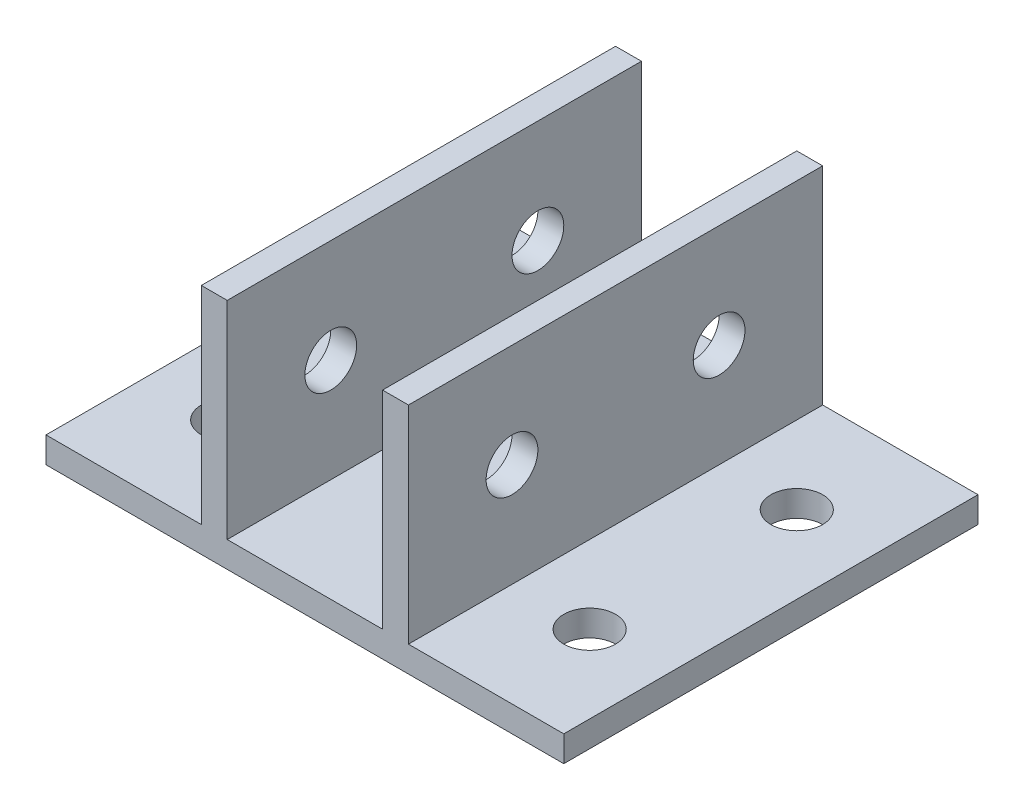
ISO-10303-21;
HEADER;
FILE_DESCRIPTION(('STEP AP214'),'2;1');
FILE_NAME('part.step','',(''),(''),'','','');
FILE_SCHEMA(('AUTOMOTIVE_DESIGN { 1 0 10303 214 1 1 1 1 }'));
ENDSEC;
DATA;
#1=APPLICATION_CONTEXT('core data for automotive mechanical design processes');
#2=APPLICATION_PROTOCOL_DEFINITION('international standard','automotive_design',2000,#1);
#3=PRODUCT_CONTEXT('',#1,'mechanical');
#4=PRODUCT('Part','Part','',(#3));
#5=PRODUCT_RELATED_PRODUCT_CATEGORY('part','',(#4));
#6=PRODUCT_DEFINITION_FORMATION('','',#4);
#7=PRODUCT_DEFINITION_CONTEXT('part definition',#1,'design');
#8=PRODUCT_DEFINITION('design','',#6,#7);
#9=PRODUCT_DEFINITION_SHAPE('','',#8);
#10=(LENGTH_UNIT() NAMED_UNIT(*) SI_UNIT(.MILLI.,.METRE.));
#11=(NAMED_UNIT(*) PLANE_ANGLE_UNIT() SI_UNIT($,.RADIAN.));
#12=(NAMED_UNIT(*) SI_UNIT($,.STERADIAN.) SOLID_ANGLE_UNIT());
#13=UNCERTAINTY_MEASURE_WITH_UNIT(LENGTH_MEASURE(1.E-05),#10,'distance_accuracy_value','');
#14=(GEOMETRIC_REPRESENTATION_CONTEXT(3) GLOBAL_UNCERTAINTY_ASSIGNED_CONTEXT((#13)) GLOBAL_UNIT_ASSIGNED_CONTEXT((#10,
#11,#12)) REPRESENTATION_CONTEXT('',''));
#15=CARTESIAN_POINT('',(0.,0.,0.));
#16=DIRECTION('',(0.,0.,1.));
#17=DIRECTION('',(1.,0.,0.));
#18=AXIS2_PLACEMENT_3D('',#15,#16,#17);
#19=CARTESIAN_POINT('',(0.,0.,50.8));
#20=DIRECTION('',(0.,1.,0.));
#21=DIRECTION('',(0.,0.,1.));
#22=AXIS2_PLACEMENT_3D('',#19,#20,#21);
#23=PLANE('',#22);
#24=CARTESIAN_POINT('',(53.975,0.,38.1));
#25=DIRECTION('',(0.,1.,0.));
#26=DIRECTION('',(-1.,0.,0.));
#27=AXIS2_PLACEMENT_3D('',#24,#25,#26);
#28=CIRCLE('',#27,3.175);
#29=CARTESIAN_POINT('',(50.8,0.,38.1));
#30=VERTEX_POINT('',#29);
#31=EDGE_CURVE('E280',#30,#30,#28,.F.);
#32=ORIENTED_EDGE('',*,*,#31,.F.);
#33=EDGE_LOOP('',(#32));
#34=FACE_BOUND('',#33,.T.);
#35=CARTESIAN_POINT('',(9.525,0.,12.7));
#36=DIRECTION('',(0.,1.,0.));
#37=DIRECTION('',(-1.,0.,0.));
#38=AXIS2_PLACEMENT_3D('',#35,#36,#37);
#39=CIRCLE('',#38,3.175);
#40=CARTESIAN_POINT('',(6.35,0.,12.7));
#41=VERTEX_POINT('',#40);
#42=EDGE_CURVE('E269',#41,#41,#39,.T.);
#43=ORIENTED_EDGE('',*,*,#42,.T.);
#44=EDGE_LOOP('',(#43));
#45=FACE_BOUND('',#44,.T.);
#46=CARTESIAN_POINT('',(9.525,0.,38.1));
#47=DIRECTION('',(0.,1.,0.));
#48=DIRECTION('',(-1.,0.,0.));
#49=AXIS2_PLACEMENT_3D('',#46,#47,#48);
#50=CIRCLE('',#49,3.175);
#51=CARTESIAN_POINT('',(6.35,0.,38.1));
#52=VERTEX_POINT('',#51);
#53=EDGE_CURVE('E286',#52,#52,#50,.F.);
#54=ORIENTED_EDGE('',*,*,#53,.F.);
#55=EDGE_LOOP('',(#54));
#56=FACE_BOUND('',#55,.T.);
#57=DIRECTION('',(1.,0.,0.));
#58=VECTOR('',#57,1.);
#59=CARTESIAN_POINT('',(0.,0.,0.));
#60=LINE('',#59,#58);
#61=CARTESIAN_POINT('',(0.,0.,0.));
#62=VERTEX_POINT('',#61);
#63=CARTESIAN_POINT('',(63.5,0.,0.));
#64=VERTEX_POINT('',#63);
#65=EDGE_CURVE('E169',#62,#64,#60,.T.);
#66=ORIENTED_EDGE('',*,*,#65,.T.);
#67=DIRECTION('',(0.,0.,-1.));
#68=VECTOR('',#67,1.);
#69=CARTESIAN_POINT('',(63.5,0.,50.8));
#70=LINE('',#69,#68);
#71=CARTESIAN_POINT('',(63.5,0.,50.8));
#72=VERTEX_POINT('',#71);
#73=EDGE_CURVE('E54',#72,#64,#70,.T.);
#74=ORIENTED_EDGE('',*,*,#73,.F.);
#75=DIRECTION('',(1.,0.,0.));
#76=VECTOR('',#75,1.);
#77=CARTESIAN_POINT('',(0.,0.,50.8));
#78=LINE('',#77,#76);
#79=CARTESIAN_POINT('',(0.,0.,50.8));
#80=VERTEX_POINT('',#79);
#81=EDGE_CURVE('E117',#80,#72,#78,.T.);
#82=ORIENTED_EDGE('',*,*,#81,.F.);
#83=DIRECTION('',(0.,0.,-1.));
#84=VECTOR('',#83,1.);
#85=CARTESIAN_POINT('',(0.,0.,50.8));
#86=LINE('',#85,#84);
#87=EDGE_CURVE('E13',#80,#62,#86,.T.);
#88=ORIENTED_EDGE('',*,*,#87,.T.);
#89=EDGE_LOOP('',(#66,#74,#82,#88));
#90=FACE_BOUND('',#89,.T.);
#91=CARTESIAN_POINT('',(53.975,0.,12.7));
#92=DIRECTION('',(0.,1.,0.));
#93=DIRECTION('',(-1.,0.,0.));
#94=AXIS2_PLACEMENT_3D('',#91,#92,#93);
#95=CIRCLE('',#94,3.175);
#96=CARTESIAN_POINT('',(50.8,0.,12.7));
#97=VERTEX_POINT('',#96);
#98=EDGE_CURVE('E270',#97,#97,#95,.T.);
#99=ORIENTED_EDGE('',*,*,#98,.T.);
#100=EDGE_LOOP('',(#99));
#101=FACE_BOUND('',#100,.T.);
#102=ADVANCED_FACE('F45',(#34,#45,#56,#90,#101),#23,.F.);
#103=CARTESIAN_POINT('',(63.5,3.17500000000001,50.8));
#104=DIRECTION('',(0.,-1.,0.));
#105=DIRECTION('',(1.,0.,0.));
#106=AXIS2_PLACEMENT_3D('',#103,#104,#105);
#107=PLANE('',#106);
#108=CARTESIAN_POINT('',(53.975,3.175,12.7));
#109=DIRECTION('',(0.,1.,0.));
#110=DIRECTION('',(-1.,0.,0.));
#111=AXIS2_PLACEMENT_3D('',#108,#109,#110);
#112=CIRCLE('',#111,3.175);
#113=CARTESIAN_POINT('',(50.8,3.175,12.7));
#114=VERTEX_POINT('',#113);
#115=EDGE_CURVE('E275',#114,#114,#112,.T.);
#116=ORIENTED_EDGE('',*,*,#115,.F.);
#117=EDGE_LOOP('',(#116));
#118=FACE_BOUND('',#117,.T.);
#119=DIRECTION('',(-1.,0.,0.));
#120=VECTOR('',#119,1.);
#121=CARTESIAN_POINT('',(63.5,3.17500000000001,0.));
#122=LINE('',#121,#120);
#123=CARTESIAN_POINT('',(63.5,3.17500000000001,0.));
#124=VERTEX_POINT('',#123);
#125=CARTESIAN_POINT('',(44.45,3.175,0.));
#126=VERTEX_POINT('',#125);
#127=EDGE_CURVE('E174',#124,#126,#122,.T.);
#128=ORIENTED_EDGE('',*,*,#127,.T.);
#129=DIRECTION('',(0.,0.,-1.));
#130=VECTOR('',#129,1.);
#131=CARTESIAN_POINT('',(44.45,3.175,50.8));
#132=LINE('',#131,#130);
#133=CARTESIAN_POINT('',(44.45,3.175,50.8));
#134=VERTEX_POINT('',#133);
#135=EDGE_CURVE('E205',#134,#126,#132,.T.);
#136=ORIENTED_EDGE('',*,*,#135,.F.);
#137=DIRECTION('',(-1.,0.,0.));
#138=VECTOR('',#137,1.);
#139=CARTESIAN_POINT('',(63.5,3.17500000000001,50.8));
#140=LINE('',#139,#138);
#141=CARTESIAN_POINT('',(63.5,3.17500000000001,50.8));
#142=VERTEX_POINT('',#141);
#143=EDGE_CURVE('E235',#142,#134,#140,.T.);
#144=ORIENTED_EDGE('',*,*,#143,.F.);
#145=DIRECTION('',(0.,0.,-1.));
#146=VECTOR('',#145,1.);
#147=CARTESIAN_POINT('',(63.5,3.17500000000001,50.8));
#148=LINE('',#147,#146);
#149=EDGE_CURVE('E208',#142,#124,#148,.T.);
#150=ORIENTED_EDGE('',*,*,#149,.T.);
#151=EDGE_LOOP('',(#128,#136,#144,#150));
#152=FACE_BOUND('',#151,.T.);
#153=CARTESIAN_POINT('',(53.975,3.175,38.1));
#154=DIRECTION('',(0.,1.,0.));
#155=DIRECTION('',(-1.,0.,0.));
#156=AXIS2_PLACEMENT_3D('',#153,#154,#155);
#157=CIRCLE('',#156,3.175);
#158=CARTESIAN_POINT('',(50.8,3.175,38.1));
#159=VERTEX_POINT('',#158);
#160=EDGE_CURVE('E283',#159,#159,#157,.F.);
#161=ORIENTED_EDGE('',*,*,#160,.T.);
#162=EDGE_LOOP('',(#161));
#163=FACE_BOUND('',#162,.T.);
#164=ADVANCED_FACE('F225',(#118,#152,#163),#107,.F.);
#165=CARTESIAN_POINT('',(19.05,3.175,50.8));
#166=DIRECTION('',(0.,-1.,0.));
#167=DIRECTION('',(1.,0.,0.));
#168=AXIS2_PLACEMENT_3D('',#165,#166,#167);
#169=PLANE('',#168);
#170=DIRECTION('',(-1.,0.,0.));
#171=VECTOR('',#170,1.);
#172=CARTESIAN_POINT('',(19.05,3.175,0.));
#173=LINE('',#172,#171);
#174=CARTESIAN_POINT('',(19.05,3.175,0.));
#175=VERTEX_POINT('',#174);
#176=CARTESIAN_POINT('',(0.,3.175,0.));
#177=VERTEX_POINT('',#176);
#178=EDGE_CURVE('E109',#175,#177,#173,.T.);
#179=ORIENTED_EDGE('',*,*,#178,.T.);
#180=DIRECTION('',(0.,0.,-1.));
#181=VECTOR('',#180,1.);
#182=CARTESIAN_POINT('',(0.,3.175,50.8));
#183=LINE('',#182,#181);
#184=CARTESIAN_POINT('',(0.,3.175,50.8));
#185=VERTEX_POINT('',#184);
#186=EDGE_CURVE('E162',#185,#177,#183,.T.);
#187=ORIENTED_EDGE('',*,*,#186,.F.);
#188=DIRECTION('',(-1.,0.,0.));
#189=VECTOR('',#188,1.);
#190=CARTESIAN_POINT('',(19.05,3.175,50.8));
#191=LINE('',#190,#189);
#192=CARTESIAN_POINT('',(19.05,3.175,50.8));
#193=VERTEX_POINT('',#192);
#194=EDGE_CURVE('E62',#193,#185,#191,.T.);
#195=ORIENTED_EDGE('',*,*,#194,.F.);
#196=DIRECTION('',(0.,0.,-1.));
#197=VECTOR('',#196,1.);
#198=CARTESIAN_POINT('',(19.05,3.175,50.8));
#199=LINE('',#198,#197);
#200=EDGE_CURVE('E158',#193,#175,#199,.T.);
#201=ORIENTED_EDGE('',*,*,#200,.T.);
#202=EDGE_LOOP('',(#179,#187,#195,#201));
#203=FACE_BOUND('',#202,.T.);
#204=CARTESIAN_POINT('',(9.525,3.175,38.1));
#205=DIRECTION('',(0.,1.,0.));
#206=DIRECTION('',(-1.,0.,0.));
#207=AXIS2_PLACEMENT_3D('',#204,#205,#206);
#208=CIRCLE('',#207,3.175);
#209=CARTESIAN_POINT('',(6.35,3.175,38.1));
#210=VERTEX_POINT('',#209);
#211=EDGE_CURVE('E264',#210,#210,#208,.F.);
#212=ORIENTED_EDGE('',*,*,#211,.T.);
#213=EDGE_LOOP('',(#212));
#214=FACE_BOUND('',#213,.T.);
#215=CARTESIAN_POINT('',(9.525,3.175,12.7));
#216=DIRECTION('',(0.,1.,0.));
#217=DIRECTION('',(-1.,0.,0.));
#218=AXIS2_PLACEMENT_3D('',#215,#216,#217);
#219=CIRCLE('',#218,3.175);
#220=CARTESIAN_POINT('',(6.35,3.175,12.7));
#221=VERTEX_POINT('',#220);
#222=EDGE_CURVE('E267',#221,#221,#219,.T.);
#223=ORIENTED_EDGE('',*,*,#222,.F.);
#224=EDGE_LOOP('',(#223));
#225=FACE_BOUND('',#224,.T.);
#226=ADVANCED_FACE('F257',(#203,#214,#225),#169,.F.);
#227=CARTESIAN_POINT('',(0.,3.175,50.8));
#228=DIRECTION('',(1.,0.,0.));
#229=DIRECTION('',(0.,1.,0.));
#230=AXIS2_PLACEMENT_3D('',#227,#228,#229);
#231=PLANE('',#230);
#232=DIRECTION('',(0.,-1.,0.));
#233=VECTOR('',#232,1.);
#234=CARTESIAN_POINT('',(0.,3.175,0.));
#235=LINE('',#234,#233);
#236=EDGE_CURVE('E166',#177,#62,#235,.T.);
#237=ORIENTED_EDGE('',*,*,#236,.T.);
#238=ORIENTED_EDGE('',*,*,#87,.F.);
#239=DIRECTION('',(0.,-1.,0.));
#240=VECTOR('',#239,1.);
#241=CARTESIAN_POINT('',(0.,3.175,50.8));
#242=LINE('',#241,#240);
#243=EDGE_CURVE('E189',#185,#80,#242,.T.);
#244=ORIENTED_EDGE('',*,*,#243,.F.);
#245=ORIENTED_EDGE('',*,*,#186,.T.);
#246=EDGE_LOOP('',(#237,#238,#244,#245));
#247=FACE_BOUND('',#246,.T.);
#248=ADVANCED_FACE('F47',(#247),#231,.F.);
#249=CARTESIAN_POINT('',(63.5,0.,50.8));
#250=DIRECTION('',(-1.,0.,0.));
#251=DIRECTION('',(0.,0.,1.));
#252=AXIS2_PLACEMENT_3D('',#249,#250,#251);
#253=PLANE('',#252);
#254=DIRECTION('',(0.,1.,0.));
#255=VECTOR('',#254,1.);
#256=CARTESIAN_POINT('',(63.5,0.,0.));
#257=LINE('',#256,#255);
#258=EDGE_CURVE('E172',#64,#124,#257,.T.);
#259=ORIENTED_EDGE('',*,*,#258,.T.);
#260=ORIENTED_EDGE('',*,*,#149,.F.);
#261=DIRECTION('',(0.,1.,0.));
#262=VECTOR('',#261,1.);
#263=CARTESIAN_POINT('',(63.5,0.,50.8));
#264=LINE('',#263,#262);
#265=EDGE_CURVE('E216',#72,#142,#264,.T.);
#266=ORIENTED_EDGE('',*,*,#265,.F.);
#267=ORIENTED_EDGE('',*,*,#73,.T.);
#268=EDGE_LOOP('',(#259,#260,#266,#267));
#269=FACE_BOUND('',#268,.T.);
#270=ADVANCED_FACE('F214',(#269),#253,.F.);
#271=CARTESIAN_POINT('',(44.45,3.175,50.8));
#272=DIRECTION('',(-1.,0.,0.));
#273=DIRECTION('',(0.,0.,1.));
#274=AXIS2_PLACEMENT_3D('',#271,#272,#273);
#275=PLANE('',#274);
#276=CARTESIAN_POINT('',(44.45,15.875,12.7));
#277=DIRECTION('',(-1.,0.,0.));
#278=DIRECTION('',(0.,0.,1.));
#279=AXIS2_PLACEMENT_3D('',#276,#277,#278);
#280=CIRCLE('',#279,3.175);
#281=CARTESIAN_POINT('',(44.45,15.875,15.875));
#282=VERTEX_POINT('',#281);
#283=EDGE_CURVE('E170',#282,#282,#280,.T.);
#284=ORIENTED_EDGE('',*,*,#283,.T.);
#285=EDGE_LOOP('',(#284));
#286=FACE_BOUND('',#285,.T.);
#287=CARTESIAN_POINT('',(44.45,15.875,38.1));
#288=DIRECTION('',(-1.,0.,0.));
#289=DIRECTION('',(0.,0.,1.));
#290=AXIS2_PLACEMENT_3D('',#287,#288,#289);
#291=CIRCLE('',#290,3.175);
#292=CARTESIAN_POINT('',(44.45,15.875,41.275));
#293=VERTEX_POINT('',#292);
#294=EDGE_CURVE('E302',#293,#293,#291,.T.);
#295=ORIENTED_EDGE('',*,*,#294,.T.);
#296=EDGE_LOOP('',(#295));
#297=FACE_BOUND('',#296,.T.);
#298=DIRECTION('',(0.,1.,0.));
#299=VECTOR('',#298,1.);
#300=CARTESIAN_POINT('',(44.45,3.175,0.));
#301=LINE('',#300,#299);
#302=CARTESIAN_POINT('',(44.45,28.575,0.));
#303=VERTEX_POINT('',#302);
#304=EDGE_CURVE('E176',#126,#303,#301,.T.);
#305=ORIENTED_EDGE('',*,*,#304,.T.);
#306=DIRECTION('',(0.,0.,-1.));
#307=VECTOR('',#306,1.);
#308=CARTESIAN_POINT('',(44.45,28.575,50.8));
#309=LINE('',#308,#307);
#310=CARTESIAN_POINT('',(44.45,28.575,50.8));
#311=VERTEX_POINT('',#310);
#312=EDGE_CURVE('E202',#311,#303,#309,.T.);
#313=ORIENTED_EDGE('',*,*,#312,.F.);
#314=DIRECTION('',(0.,1.,0.));
#315=VECTOR('',#314,1.);
#316=CARTESIAN_POINT('',(44.45,3.175,50.8));
#317=LINE('',#316,#315);
#318=EDGE_CURVE('E232',#134,#311,#317,.T.);
#319=ORIENTED_EDGE('',*,*,#318,.F.);
#320=ORIENTED_EDGE('',*,*,#135,.T.);
#321=EDGE_LOOP('',(#305,#313,#319,#320));
#322=FACE_BOUND('',#321,.T.);
#323=ADVANCED_FACE('F230',(#286,#297,#322),#275,.F.);
#324=CARTESIAN_POINT('',(44.45,28.575,50.8));
#325=DIRECTION('',(0.,-1.,0.));
#326=DIRECTION('',(1.,0.,0.));
#327=AXIS2_PLACEMENT_3D('',#324,#325,#326);
#328=PLANE('',#327);
#329=DIRECTION('',(-1.,0.,0.));
#330=VECTOR('',#329,1.);
#331=CARTESIAN_POINT('',(44.45,28.575,0.));
#332=LINE('',#331,#330);
#333=CARTESIAN_POINT('',(41.275,28.575,0.));
#334=VERTEX_POINT('',#333);
#335=EDGE_CURVE('E178',#303,#334,#332,.T.);
#336=ORIENTED_EDGE('',*,*,#335,.T.);
#337=DIRECTION('',(0.,0.,-1.));
#338=VECTOR('',#337,1.);
#339=CARTESIAN_POINT('',(41.275,28.575,50.8));
#340=LINE('',#339,#338);
#341=CARTESIAN_POINT('',(41.275,28.575,50.8));
#342=VERTEX_POINT('',#341);
#343=EDGE_CURVE('E199',#342,#334,#340,.T.);
#344=ORIENTED_EDGE('',*,*,#343,.F.);
#345=DIRECTION('',(-1.,0.,0.));
#346=VECTOR('',#345,1.);
#347=CARTESIAN_POINT('',(44.45,28.575,50.8));
#348=LINE('',#347,#346);
#349=EDGE_CURVE('E234',#311,#342,#348,.T.);
#350=ORIENTED_EDGE('',*,*,#349,.F.);
#351=ORIENTED_EDGE('',*,*,#312,.T.);
#352=EDGE_LOOP('',(#336,#344,#350,#351));
#353=FACE_BOUND('',#352,.T.);
#354=ADVANCED_FACE('F352',(#353),#328,.F.);
#355=CARTESIAN_POINT('',(41.275,28.575,50.8));
#356=DIRECTION('',(1.,0.,0.));
#357=DIRECTION('',(0.,1.,0.));
#358=AXIS2_PLACEMENT_3D('',#355,#356,#357);
#359=PLANE('',#358);
#360=CARTESIAN_POINT('',(41.275,15.875,12.7));
#361=DIRECTION('',(1.,0.,0.));
#362=DIRECTION('',(0.,1.,0.));
#363=AXIS2_PLACEMENT_3D('',#360,#361,#362);
#364=CIRCLE('',#363,3.175);
#365=CARTESIAN_POINT('',(41.275,19.05,12.7));
#366=VERTEX_POINT('',#365);
#367=EDGE_CURVE('E308',#366,#366,#364,.T.);
#368=ORIENTED_EDGE('',*,*,#367,.T.);
#369=EDGE_LOOP('',(#368));
#370=FACE_BOUND('',#369,.T.);
#371=CARTESIAN_POINT('',(41.275,15.875,38.1));
#372=DIRECTION('',(1.,0.,0.));
#373=DIRECTION('',(0.,1.,0.));
#374=AXIS2_PLACEMENT_3D('',#371,#372,#373);
#375=CIRCLE('',#374,3.175);
#376=CARTESIAN_POINT('',(41.275,19.05,38.1));
#377=VERTEX_POINT('',#376);
#378=EDGE_CURVE('E299',#377,#377,#375,.T.);
#379=ORIENTED_EDGE('',*,*,#378,.T.);
#380=EDGE_LOOP('',(#379));
#381=FACE_BOUND('',#380,.T.);
#382=DIRECTION('',(0.,-1.,0.));
#383=VECTOR('',#382,1.);
#384=CARTESIAN_POINT('',(41.275,28.575,0.));
#385=LINE('',#384,#383);
#386=CARTESIAN_POINT('',(41.275,3.175,0.));
#387=VERTEX_POINT('',#386);
#388=EDGE_CURVE('E180',#334,#387,#385,.T.);
#389=ORIENTED_EDGE('',*,*,#388,.T.);
#390=DIRECTION('',(0.,0.,-1.));
#391=VECTOR('',#390,1.);
#392=CARTESIAN_POINT('',(41.275,3.175,50.8));
#393=LINE('',#392,#391);
#394=CARTESIAN_POINT('',(41.275,3.175,50.8));
#395=VERTEX_POINT('',#394);
#396=EDGE_CURVE('E196',#395,#387,#393,.T.);
#397=ORIENTED_EDGE('',*,*,#396,.F.);
#398=DIRECTION('',(0.,-1.,0.));
#399=VECTOR('',#398,1.);
#400=CARTESIAN_POINT('',(41.275,28.575,50.8));
#401=LINE('',#400,#399);
#402=EDGE_CURVE('E237',#342,#395,#401,.T.);
#403=ORIENTED_EDGE('',*,*,#402,.F.);
#404=ORIENTED_EDGE('',*,*,#343,.T.);
#405=EDGE_LOOP('',(#389,#397,#403,#404));
#406=FACE_BOUND('',#405,.T.);
#407=ADVANCED_FACE('F355',(#370,#381,#406),#359,.F.);
#408=CARTESIAN_POINT('',(41.275,3.175,50.8));
#409=DIRECTION('',(0.,-1.,0.));
#410=DIRECTION('',(1.,0.,0.));
#411=AXIS2_PLACEMENT_3D('',#408,#409,#410);
#412=PLANE('',#411);
#413=DIRECTION('',(-1.,0.,0.));
#414=VECTOR('',#413,1.);
#415=CARTESIAN_POINT('',(41.275,3.175,0.));
#416=LINE('',#415,#414);
#417=CARTESIAN_POINT('',(22.225,3.175,0.));
#418=VERTEX_POINT('',#417);
#419=EDGE_CURVE('E182',#387,#418,#416,.T.);
#420=ORIENTED_EDGE('',*,*,#419,.T.);
#421=DIRECTION('',(0.,0.,-1.));
#422=VECTOR('',#421,1.);
#423=CARTESIAN_POINT('',(22.225,3.175,50.8));
#424=LINE('',#423,#422);
#425=CARTESIAN_POINT('',(22.225,3.175,50.8));
#426=VERTEX_POINT('',#425);
#427=EDGE_CURVE('E193',#426,#418,#424,.T.);
#428=ORIENTED_EDGE('',*,*,#427,.F.);
#429=DIRECTION('',(-1.,0.,0.));
#430=VECTOR('',#429,1.);
#431=CARTESIAN_POINT('',(41.275,3.175,50.8));
#432=LINE('',#431,#430);
#433=EDGE_CURVE('E243',#395,#426,#432,.T.);
#434=ORIENTED_EDGE('',*,*,#433,.F.);
#435=ORIENTED_EDGE('',*,*,#396,.T.);
#436=EDGE_LOOP('',(#420,#428,#434,#435));
#437=FACE_BOUND('',#436,.T.);
#438=ADVANCED_FACE('F249',(#437),#412,.F.);
#439=CARTESIAN_POINT('',(22.225,3.175,50.8));
#440=DIRECTION('',(-1.,0.,0.));
#441=DIRECTION('',(0.,-1.,0.));
#442=AXIS2_PLACEMENT_3D('',#439,#440,#441);
#443=PLANE('',#442);
#444=CARTESIAN_POINT('',(22.225,15.875,12.7));
#445=DIRECTION('',(-1.,0.,0.));
#446=DIRECTION('',(0.,-1.,0.));
#447=AXIS2_PLACEMENT_3D('',#444,#445,#446);
#448=CIRCLE('',#447,3.175);
#449=CARTESIAN_POINT('',(22.225,12.7,12.7));
#450=VERTEX_POINT('',#449);
#451=EDGE_CURVE('E305',#450,#450,#448,.T.);
#452=ORIENTED_EDGE('',*,*,#451,.T.);
#453=EDGE_LOOP('',(#452));
#454=FACE_BOUND('',#453,.T.);
#455=CARTESIAN_POINT('',(22.225,15.875,38.1));
#456=DIRECTION('',(-1.,0.,0.));
#457=DIRECTION('',(0.,-1.,0.));
#458=AXIS2_PLACEMENT_3D('',#455,#456,#457);
#459=CIRCLE('',#458,3.175);
#460=CARTESIAN_POINT('',(22.225,12.7,38.1));
#461=VERTEX_POINT('',#460);
#462=EDGE_CURVE('E294',#461,#461,#459,.T.);
#463=ORIENTED_EDGE('',*,*,#462,.T.);
#464=EDGE_LOOP('',(#463));
#465=FACE_BOUND('',#464,.T.);
#466=DIRECTION('',(0.,1.,0.));
#467=VECTOR('',#466,1.);
#468=CARTESIAN_POINT('',(22.225,3.175,0.));
#469=LINE('',#468,#467);
#470=CARTESIAN_POINT('',(22.225,28.575,0.));
#471=VERTEX_POINT('',#470);
#472=EDGE_CURVE('E184',#418,#471,#469,.T.);
#473=ORIENTED_EDGE('',*,*,#472,.T.);
#474=DIRECTION('',(0.,0.,-1.));
#475=VECTOR('',#474,1.);
#476=CARTESIAN_POINT('',(22.225,28.575,50.8));
#477=LINE('',#476,#475);
#478=CARTESIAN_POINT('',(22.225,28.575,50.8));
#479=VERTEX_POINT('',#478);
#480=EDGE_CURVE('E157',#479,#471,#477,.T.);
#481=ORIENTED_EDGE('',*,*,#480,.F.);
#482=DIRECTION('',(0.,1.,0.));
#483=VECTOR('',#482,1.);
#484=CARTESIAN_POINT('',(22.225,3.175,50.8));
#485=LINE('',#484,#483);
#486=EDGE_CURVE('E148',#426,#479,#485,.T.);
#487=ORIENTED_EDGE('',*,*,#486,.F.);
#488=ORIENTED_EDGE('',*,*,#427,.T.);
#489=EDGE_LOOP('',(#473,#481,#487,#488));
#490=FACE_BOUND('',#489,.T.);
#491=ADVANCED_FACE('F253',(#454,#465,#490),#443,.F.);
#492=CARTESIAN_POINT('',(22.225,28.575,50.8));
#493=DIRECTION('',(0.,-1.,0.));
#494=DIRECTION('',(0.,0.,-1.));
#495=AXIS2_PLACEMENT_3D('',#492,#493,#494);
#496=PLANE('',#495);
#497=DIRECTION('',(-1.,0.,0.));
#498=VECTOR('',#497,1.);
#499=CARTESIAN_POINT('',(22.225,28.575,0.));
#500=LINE('',#499,#498);
#501=CARTESIAN_POINT('',(19.05,28.575,0.));
#502=VERTEX_POINT('',#501);
#503=EDGE_CURVE('E156',#471,#502,#500,.T.);
#504=ORIENTED_EDGE('',*,*,#503,.T.);
#505=DIRECTION('',(0.,0.,-1.));
#506=VECTOR('',#505,1.);
#507=CARTESIAN_POINT('',(19.05,28.575,50.8));
#508=LINE('',#507,#506);
#509=CARTESIAN_POINT('',(19.05,28.575,50.8));
#510=VERTEX_POINT('',#509);
#511=EDGE_CURVE('E153',#510,#502,#508,.T.);
#512=ORIENTED_EDGE('',*,*,#511,.F.);
#513=DIRECTION('',(-1.,0.,0.));
#514=VECTOR('',#513,1.);
#515=CARTESIAN_POINT('',(22.225,28.575,50.8));
#516=LINE('',#515,#514);
#517=EDGE_CURVE('E142',#479,#510,#516,.T.);
#518=ORIENTED_EDGE('',*,*,#517,.F.);
#519=ORIENTED_EDGE('',*,*,#480,.T.);
#520=EDGE_LOOP('',(#504,#512,#518,#519));
#521=FACE_BOUND('',#520,.T.);
#522=ADVANCED_FACE('F154',(#521),#496,.F.);
#523=CARTESIAN_POINT('',(19.05,28.575,50.8));
#524=DIRECTION('',(1.,0.,0.));
#525=DIRECTION('',(0.,1.,0.));
#526=AXIS2_PLACEMENT_3D('',#523,#524,#525);
#527=PLANE('',#526);
#528=CARTESIAN_POINT('',(19.05,15.875,12.7));
#529=DIRECTION('',(-1.,0.,0.));
#530=DIRECTION('',(0.,-1.,0.));
#531=AXIS2_PLACEMENT_3D('',#528,#529,#530);
#532=CIRCLE('',#531,3.175);
#533=CARTESIAN_POINT('',(19.05,12.7,12.7));
#534=VERTEX_POINT('',#533);
#535=EDGE_CURVE('E291',#534,#534,#532,.T.);
#536=ORIENTED_EDGE('',*,*,#535,.F.);
#537=EDGE_LOOP('',(#536));
#538=FACE_BOUND('',#537,.T.);
#539=CARTESIAN_POINT('',(19.05,15.875,38.1));
#540=DIRECTION('',(-1.,0.,0.));
#541=DIRECTION('',(0.,-1.,0.));
#542=AXIS2_PLACEMENT_3D('',#539,#540,#541);
#543=CIRCLE('',#542,3.175);
#544=CARTESIAN_POINT('',(19.05,12.7,38.1));
#545=VERTEX_POINT('',#544);
#546=EDGE_CURVE('E289',#545,#545,#543,.T.);
#547=ORIENTED_EDGE('',*,*,#546,.F.);
#548=EDGE_LOOP('',(#547));
#549=FACE_BOUND('',#548,.T.);
#550=DIRECTION('',(0.,-1.,0.));
#551=VECTOR('',#550,1.);
#552=CARTESIAN_POINT('',(19.05,28.575,0.));
#553=LINE('',#552,#551);
#554=EDGE_CURVE('E103',#502,#175,#553,.T.);
#555=ORIENTED_EDGE('',*,*,#554,.T.);
#556=ORIENTED_EDGE('',*,*,#200,.F.);
#557=DIRECTION('',(0.,-1.,0.));
#558=VECTOR('',#557,1.);
#559=CARTESIAN_POINT('',(19.05,28.575,50.8));
#560=LINE('',#559,#558);
#561=EDGE_CURVE('E146',#510,#193,#560,.T.);
#562=ORIENTED_EDGE('',*,*,#561,.F.);
#563=ORIENTED_EDGE('',*,*,#511,.T.);
#564=EDGE_LOOP('',(#555,#556,#562,#563));
#565=FACE_BOUND('',#564,.T.);
#566=ADVANCED_FACE('F160',(#538,#549,#565),#527,.F.);
#567=CARTESIAN_POINT('',(0.,0.,50.8));
#568=DIRECTION('',(0.,0.,1.));
#569=DIRECTION('',(1.,0.,0.));
#570=AXIS2_PLACEMENT_3D('',#567,#568,#569);
#571=PLANE('',#570);
#572=ORIENTED_EDGE('',*,*,#243,.T.);
#573=ORIENTED_EDGE('',*,*,#81,.T.);
#574=ORIENTED_EDGE('',*,*,#265,.T.);
#575=ORIENTED_EDGE('',*,*,#143,.T.);
#576=ORIENTED_EDGE('',*,*,#318,.T.);
#577=ORIENTED_EDGE('',*,*,#349,.T.);
#578=ORIENTED_EDGE('',*,*,#402,.T.);
#579=ORIENTED_EDGE('',*,*,#433,.T.);
#580=ORIENTED_EDGE('',*,*,#486,.T.);
#581=ORIENTED_EDGE('',*,*,#517,.T.);
#582=ORIENTED_EDGE('',*,*,#561,.T.);
#583=ORIENTED_EDGE('',*,*,#194,.T.);
#584=EDGE_LOOP('',(#572,#573,#574,#575,#576,#577,#578,#579,#580,#581,#582,#583));
#585=FACE_BOUND('',#584,.T.);
#586=ADVANCED_FACE('F144',(#585),#571,.T.);
#587=CARTESIAN_POINT('',(0.,0.,0.));
#588=DIRECTION('',(0.,0.,1.));
#589=DIRECTION('',(1.,0.,0.));
#590=AXIS2_PLACEMENT_3D('',#587,#588,#589);
#591=PLANE('',#590);
#592=ORIENTED_EDGE('',*,*,#236,.F.);
#593=ORIENTED_EDGE('',*,*,#178,.F.);
#594=ORIENTED_EDGE('',*,*,#554,.F.);
#595=ORIENTED_EDGE('',*,*,#503,.F.);
#596=ORIENTED_EDGE('',*,*,#472,.F.);
#597=ORIENTED_EDGE('',*,*,#419,.F.);
#598=ORIENTED_EDGE('',*,*,#388,.F.);
#599=ORIENTED_EDGE('',*,*,#335,.F.);
#600=ORIENTED_EDGE('',*,*,#304,.F.);
#601=ORIENTED_EDGE('',*,*,#127,.F.);
#602=ORIENTED_EDGE('',*,*,#258,.F.);
#603=ORIENTED_EDGE('',*,*,#65,.F.);
#604=EDGE_LOOP('',(#592,#593,#594,#595,#596,#597,#598,#599,#600,#601,#602,#603));
#605=FACE_BOUND('',#604,.T.);
#606=ADVANCED_FACE('F220',(#605),#591,.F.);
#607=CARTESIAN_POINT('',(63.5,15.875,38.1));
#608=DIRECTION('',(-1.,0.,0.));
#609=DIRECTION('',(0.,-1.,0.));
#610=AXIS2_PLACEMENT_3D('',#607,#608,#609);
#611=CYLINDRICAL_SURFACE('',#610,3.175);
#612=ORIENTED_EDGE('',*,*,#546,.T.);
#613=EDGE_LOOP('',(#612));
#614=FACE_BOUND('',#613,.T.);
#615=ORIENTED_EDGE('',*,*,#462,.F.);
#616=EDGE_LOOP('',(#615));
#617=FACE_BOUND('',#616,.T.);
#618=ADVANCED_FACE('F334',(#614,#617),#611,.F.);
#619=CARTESIAN_POINT('',(63.5,15.875,12.7));
#620=DIRECTION('',(-1.,0.,0.));
#621=DIRECTION('',(0.,-1.,0.));
#622=AXIS2_PLACEMENT_3D('',#619,#620,#621);
#623=CYLINDRICAL_SURFACE('',#622,3.175);
#624=ORIENTED_EDGE('',*,*,#535,.T.);
#625=EDGE_LOOP('',(#624));
#626=FACE_BOUND('',#625,.T.);
#627=ORIENTED_EDGE('',*,*,#451,.F.);
#628=EDGE_LOOP('',(#627));
#629=FACE_BOUND('',#628,.T.);
#630=ADVANCED_FACE('F324',(#626,#629),#623,.F.);
#631=ORIENTED_EDGE('',*,*,#378,.F.);
#632=EDGE_LOOP('',(#631));
#633=FACE_BOUND('',#632,.T.);
#634=ORIENTED_EDGE('',*,*,#294,.F.);
#635=EDGE_LOOP('',(#634));
#636=FACE_BOUND('',#635,.T.);
#637=ADVANCED_FACE('F321',(#633,#636),#611,.F.);
#638=ORIENTED_EDGE('',*,*,#367,.F.);
#639=EDGE_LOOP('',(#638));
#640=FACE_BOUND('',#639,.T.);
#641=ORIENTED_EDGE('',*,*,#283,.F.);
#642=EDGE_LOOP('',(#641));
#643=FACE_BOUND('',#642,.T.);
#644=ADVANCED_FACE('F318',(#640,#643),#623,.F.);
#645=CARTESIAN_POINT('',(9.525,0.,38.1));
#646=DIRECTION('',(0.,1.,0.));
#647=DIRECTION('',(-1.,0.,0.));
#648=AXIS2_PLACEMENT_3D('',#645,#646,#647);
#649=CYLINDRICAL_SURFACE('',#648,3.175);
#650=ORIENTED_EDGE('',*,*,#53,.T.);
#651=EDGE_LOOP('',(#650));
#652=FACE_BOUND('',#651,.T.);
#653=ORIENTED_EDGE('',*,*,#211,.F.);
#654=EDGE_LOOP('',(#653));
#655=FACE_BOUND('',#654,.T.);
#656=ADVANCED_FACE('F320',(#652,#655),#649,.F.);
#657=CARTESIAN_POINT('',(9.525,0.,12.7));
#658=DIRECTION('',(0.,1.,0.));
#659=DIRECTION('',(-1.,0.,0.));
#660=AXIS2_PLACEMENT_3D('',#657,#658,#659);
#661=CYLINDRICAL_SURFACE('',#660,3.175);
#662=ORIENTED_EDGE('',*,*,#42,.F.);
#663=EDGE_LOOP('',(#662));
#664=FACE_BOUND('',#663,.T.);
#665=ORIENTED_EDGE('',*,*,#222,.T.);
#666=EDGE_LOOP('',(#665));
#667=FACE_BOUND('',#666,.T.);
#668=ADVANCED_FACE('F329',(#664,#667),#661,.F.);
#669=CARTESIAN_POINT('',(53.975,0.,12.7));
#670=DIRECTION('',(0.,1.,0.));
#671=DIRECTION('',(-1.,0.,0.));
#672=AXIS2_PLACEMENT_3D('',#669,#670,#671);
#673=CYLINDRICAL_SURFACE('',#672,3.175);
#674=ORIENTED_EDGE('',*,*,#98,.F.);
#675=EDGE_LOOP('',(#674));
#676=FACE_BOUND('',#675,.T.);
#677=ORIENTED_EDGE('',*,*,#115,.T.);
#678=EDGE_LOOP('',(#677));
#679=FACE_BOUND('',#678,.T.);
#680=ADVANCED_FACE('F433',(#676,#679),#673,.F.);
#681=CARTESIAN_POINT('',(53.975,0.,38.1));
#682=DIRECTION('',(0.,1.,0.));
#683=DIRECTION('',(-1.,0.,0.));
#684=AXIS2_PLACEMENT_3D('',#681,#682,#683);
#685=CYLINDRICAL_SURFACE('',#684,3.175);
#686=ORIENTED_EDGE('',*,*,#31,.T.);
#687=EDGE_LOOP('',(#686));
#688=FACE_BOUND('',#687,.T.);
#689=ORIENTED_EDGE('',*,*,#160,.F.);
#690=EDGE_LOOP('',(#689));
#691=FACE_BOUND('',#690,.T.);
#692=ADVANCED_FACE('F443',(#688,#691),#685,.F.);
#693=CLOSED_SHELL('',(#102,#164,#226,#248,#270,#323,#354,#407,#438,#491,#522,#566,#586,#606,
#618,#630,#637,#644,#656,#668,#680,#692));
#694=MANIFOLD_SOLID_BREP('B2',#693);
#695=ADVANCED_BREP_SHAPE_REPRESENTATION('',(#18,#694),#14);
#696=SHAPE_DEFINITION_REPRESENTATION(#9,#695);
ENDSEC;
END-ISO-10303-21;
